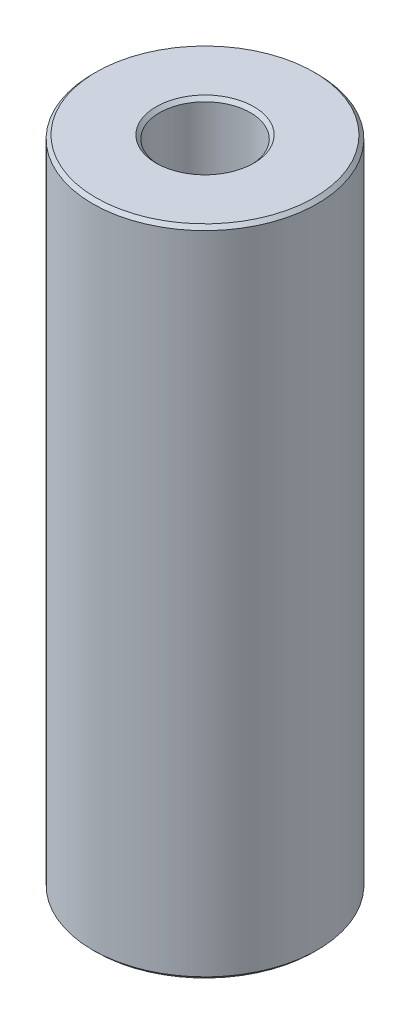
ISO-10303-21;
HEADER;
FILE_DESCRIPTION(('STEP AP214'),'2;1');
FILE_NAME('part.step','',(''),(''),'','','');
FILE_SCHEMA(('AUTOMOTIVE_DESIGN { 1 0 10303 214 1 1 1 1 }'));
ENDSEC;
DATA;
#1=APPLICATION_CONTEXT('core data for automotive mechanical design processes');
#2=APPLICATION_PROTOCOL_DEFINITION('international standard','automotive_design',2000,#1);
#3=PRODUCT_CONTEXT('',#1,'mechanical');
#4=PRODUCT('Part','Part','',(#3));
#5=PRODUCT_RELATED_PRODUCT_CATEGORY('part','',(#4));
#6=PRODUCT_DEFINITION_FORMATION('','',#4);
#7=PRODUCT_DEFINITION_CONTEXT('part definition',#1,'design');
#8=PRODUCT_DEFINITION('design','',#6,#7);
#9=PRODUCT_DEFINITION_SHAPE('','',#8);
#10=(LENGTH_UNIT() NAMED_UNIT(*) SI_UNIT(.MILLI.,.METRE.));
#11=(NAMED_UNIT(*) PLANE_ANGLE_UNIT() SI_UNIT($,.RADIAN.));
#12=(NAMED_UNIT(*) SI_UNIT($,.STERADIAN.) SOLID_ANGLE_UNIT());
#13=UNCERTAINTY_MEASURE_WITH_UNIT(LENGTH_MEASURE(1.E-05),#10,'distance_accuracy_value','');
#14=(GEOMETRIC_REPRESENTATION_CONTEXT(3) GLOBAL_UNCERTAINTY_ASSIGNED_CONTEXT((#13)) GLOBAL_UNIT_ASSIGNED_CONTEXT((#10,
#11,#12)) REPRESENTATION_CONTEXT('',''));
#15=CARTESIAN_POINT('',(0.,0.,0.));
#16=DIRECTION('',(0.,0.,1.));
#17=DIRECTION('',(1.,0.,0.));
#18=AXIS2_PLACEMENT_3D('',#15,#16,#17);
#19=CARTESIAN_POINT('',(0.,319.697759107881,0.));
#20=DIRECTION('',(0.,-1.,0.));
#21=DIRECTION('',(0.,0.,-1.));
#22=AXIS2_PLACEMENT_3D('',#19,#20,#21);
#23=CYLINDRICAL_SURFACE('',#22,55.);
#24=CARTESIAN_POINT('',(0.,1.68776173385116,0.));
#25=DIRECTION('',(0.,1.,0.));
#26=DIRECTION('',(0.,0.,1.));
#27=AXIS2_PLACEMENT_3D('',#24,#25,#26);
#28=CIRCLE('',#27,55.);
#29=CARTESIAN_POINT('',(0.,1.68776173385116,55.));
#30=VERTEX_POINT('',#29);
#31=EDGE_CURVE('E10',#30,#30,#28,.T.);
#32=ORIENTED_EDGE('',*,*,#31,.T.);
#33=EDGE_LOOP('',(#32));
#34=FACE_BOUND('',#33,.T.);
#35=CARTESIAN_POINT('',(0.,318.00999737403,0.));
#36=DIRECTION('',(0.,1.,0.));
#37=DIRECTION('',(0.,0.,1.));
#38=AXIS2_PLACEMENT_3D('',#35,#36,#37);
#39=CIRCLE('',#38,55.);
#40=CARTESIAN_POINT('',(0.,318.00999737403,55.));
#41=VERTEX_POINT('',#40);
#42=EDGE_CURVE('E50',#41,#41,#39,.F.);
#43=ORIENTED_EDGE('',*,*,#42,.T.);
#44=EDGE_LOOP('',(#43));
#45=FACE_BOUND('',#44,.T.);
#46=ADVANCED_FACE('F39',(#34,#45),#23,.T.);
#47=CARTESIAN_POINT('',(0.,319.697759107881,0.));
#48=DIRECTION('',(0.,1.,0.));
#49=DIRECTION('',(0.,0.,1.));
#50=AXIS2_PLACEMENT_3D('',#47,#48,#49);
#51=PLANE('',#50);
#52=CARTESIAN_POINT('',(0.,319.697759107881,0.));
#53=DIRECTION('',(0.,1.,0.));
#54=DIRECTION('',(0.,0.,1.));
#55=AXIS2_PLACEMENT_3D('',#52,#53,#54);
#56=CIRCLE('',#55,23.9423429360782);
#57=CARTESIAN_POINT('',(0.,319.697759107881,23.9423429360782));
#58=VERTEX_POINT('',#57);
#59=EDGE_CURVE('E58',#58,#58,#56,.F.);
#60=ORIENTED_EDGE('',*,*,#59,.T.);
#61=EDGE_LOOP('',(#60));
#62=FACE_BOUND('',#61,.T.);
#63=CARTESIAN_POINT('',(0.,319.697759107881,0.));
#64=DIRECTION('',(0.,1.,0.));
#65=DIRECTION('',(0.,0.,1.));
#66=AXIS2_PLACEMENT_3D('',#63,#64,#65);
#67=CIRCLE('',#66,53.3122382661488);
#68=CARTESIAN_POINT('',(0.,319.697759107881,53.3122382661488));
#69=VERTEX_POINT('',#68);
#70=EDGE_CURVE('E61',#69,#69,#67,.T.);
#71=ORIENTED_EDGE('',*,*,#70,.T.);
#72=EDGE_LOOP('',(#71));
#73=FACE_BOUND('',#72,.T.);
#74=ADVANCED_FACE('F88',(#62,#73),#51,.T.);
#75=CARTESIAN_POINT('',(0.,0.,0.));
#76=DIRECTION('',(0.,1.,0.));
#77=DIRECTION('',(0.,0.,1.));
#78=AXIS2_PLACEMENT_3D('',#75,#76,#77);
#79=PLANE('',#78);
#80=CARTESIAN_POINT('',(0.,0.,0.));
#81=DIRECTION('',(0.,1.,0.));
#82=DIRECTION('',(0.,0.,1.));
#83=AXIS2_PLACEMENT_3D('',#80,#81,#82);
#84=CIRCLE('',#83,23.9423429360783);
#85=CARTESIAN_POINT('',(0.,0.,23.9423429360783));
#86=VERTEX_POINT('',#85);
#87=EDGE_CURVE('E51',#86,#86,#84,.T.);
#88=ORIENTED_EDGE('',*,*,#87,.T.);
#89=EDGE_LOOP('',(#88));
#90=FACE_BOUND('',#89,.T.);
#91=CARTESIAN_POINT('',(0.,0.,0.));
#92=DIRECTION('',(0.,1.,0.));
#93=DIRECTION('',(0.,0.,1.));
#94=AXIS2_PLACEMENT_3D('',#91,#92,#93);
#95=CIRCLE('',#94,53.3122382661488);
#96=CARTESIAN_POINT('',(0.,0.,53.3122382661488));
#97=VERTEX_POINT('',#96);
#98=EDGE_CURVE('E54',#97,#97,#95,.F.);
#99=ORIENTED_EDGE('',*,*,#98,.T.);
#100=EDGE_LOOP('',(#99));
#101=FACE_BOUND('',#100,.T.);
#102=ADVANCED_FACE('F83',(#90,#101),#79,.F.);
#103=CARTESIAN_POINT('',(0.,319.697759107881,0.));
#104=DIRECTION('',(0.,-1.,0.));
#105=DIRECTION('',(0.,0.,-1.));
#106=AXIS2_PLACEMENT_3D('',#103,#104,#105);
#107=CYLINDRICAL_SURFACE('',#106,22.2545812022271);
#108=CARTESIAN_POINT('',(0.,318.00999737403,0.));
#109=DIRECTION('',(0.,1.,0.));
#110=DIRECTION('',(0.,0.,1.));
#111=AXIS2_PLACEMENT_3D('',#108,#109,#110);
#112=CIRCLE('',#111,22.2545812022271);
#113=CARTESIAN_POINT('',(0.,318.00999737403,22.2545812022271));
#114=VERTEX_POINT('',#113);
#115=EDGE_CURVE('E67',#114,#114,#112,.T.);
#116=ORIENTED_EDGE('',*,*,#115,.T.);
#117=EDGE_LOOP('',(#116));
#118=FACE_BOUND('',#117,.T.);
#119=CARTESIAN_POINT('',(0.,1.68776173385121,0.));
#120=DIRECTION('',(0.,1.,0.));
#121=DIRECTION('',(0.,0.,1.));
#122=AXIS2_PLACEMENT_3D('',#119,#120,#121);
#123=CIRCLE('',#122,22.2545812022271);
#124=CARTESIAN_POINT('',(0.,1.68776173385121,22.2545812022271));
#125=VERTEX_POINT('',#124);
#126=EDGE_CURVE('E69',#125,#125,#123,.F.);
#127=ORIENTED_EDGE('',*,*,#126,.T.);
#128=EDGE_LOOP('',(#127));
#129=FACE_BOUND('',#128,.T.);
#130=ADVANCED_FACE('F71',(#118,#129),#107,.F.);
#131=CARTESIAN_POINT('',(0.,318.00999737403,0.));
#132=DIRECTION('',(0.,1.,0.));
#133=DIRECTION('',(0.,0.,1.));
#134=AXIS2_PLACEMENT_3D('',#131,#132,#133);
#135=CONICAL_SURFACE('',#134,22.2545812022271,0.785398163397455);
#136=ORIENTED_EDGE('',*,*,#59,.F.);
#137=EDGE_LOOP('',(#136));
#138=FACE_BOUND('',#137,.T.);
#139=ORIENTED_EDGE('',*,*,#115,.F.);
#140=EDGE_LOOP('',(#139));
#141=FACE_BOUND('',#140,.T.);
#142=ADVANCED_FACE('F77',(#138,#141),#135,.F.);
#143=CARTESIAN_POINT('',(0.,0.,0.));
#144=DIRECTION('',(0.,-1.,0.));
#145=DIRECTION('',(0.,0.,-1.));
#146=AXIS2_PLACEMENT_3D('',#143,#144,#145);
#147=CONICAL_SURFACE('',#146,23.9423429360783,0.78539816339744);
#148=ORIENTED_EDGE('',*,*,#126,.F.);
#149=EDGE_LOOP('',(#148));
#150=FACE_BOUND('',#149,.T.);
#151=ORIENTED_EDGE('',*,*,#87,.F.);
#152=EDGE_LOOP('',(#151));
#153=FACE_BOUND('',#152,.T.);
#154=ADVANCED_FACE('F73',(#150,#153),#147,.F.);
#155=CARTESIAN_POINT('',(0.,1.68776173385116,0.));
#156=DIRECTION('',(0.,1.,0.));
#157=DIRECTION('',(0.,0.,1.));
#158=AXIS2_PLACEMENT_3D('',#155,#156,#157);
#159=CONICAL_SURFACE('',#158,55.,0.785398163397459);
#160=ORIENTED_EDGE('',*,*,#98,.F.);
#161=EDGE_LOOP('',(#160));
#162=FACE_BOUND('',#161,.T.);
#163=ORIENTED_EDGE('',*,*,#31,.F.);
#164=EDGE_LOOP('',(#163));
#165=FACE_BOUND('',#164,.T.);
#166=ADVANCED_FACE('F76',(#162,#165),#159,.T.);
#167=CARTESIAN_POINT('',(0.,319.697759107881,0.));
#168=DIRECTION('',(0.,-1.,0.));
#169=DIRECTION('',(0.,0.,-1.));
#170=AXIS2_PLACEMENT_3D('',#167,#168,#169);
#171=CONICAL_SURFACE('',#170,53.3122382661488,0.785398163397448);
#172=ORIENTED_EDGE('',*,*,#42,.F.);
#173=EDGE_LOOP('',(#172));
#174=FACE_BOUND('',#173,.T.);
#175=ORIENTED_EDGE('',*,*,#70,.F.);
#176=EDGE_LOOP('',(#175));
#177=FACE_BOUND('',#176,.T.);
#178=ADVANCED_FACE('F45',(#174,#177),#171,.T.);
#179=CLOSED_SHELL('',(#46,#74,#102,#130,#142,#154,#166,#178));
#180=MANIFOLD_SOLID_BREP('B2',#179);
#181=ADVANCED_BREP_SHAPE_REPRESENTATION('',(#18,#180),#14);
#182=SHAPE_DEFINITION_REPRESENTATION(#9,#181);
ENDSEC;
END-ISO-10303-21;
